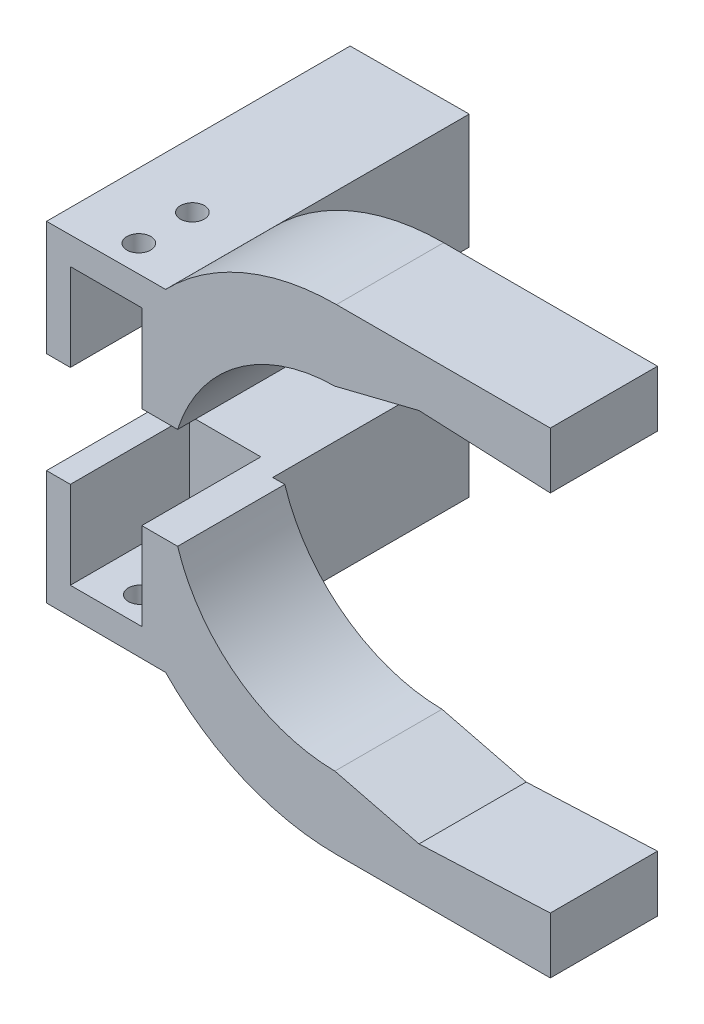
ISO-10303-21;
HEADER;
FILE_DESCRIPTION(('STEP AP214'),'2;1');
FILE_NAME('part.step','',(''),(''),'','','');
FILE_SCHEMA(('AUTOMOTIVE_DESIGN { 1 0 10303 214 1 1 1 1 }'));
ENDSEC;
DATA;
#1=APPLICATION_CONTEXT('core data for automotive mechanical design processes');
#2=APPLICATION_PROTOCOL_DEFINITION('international standard','automotive_design',2000,#1);
#3=PRODUCT_CONTEXT('',#1,'mechanical');
#4=PRODUCT('Part','Part','',(#3));
#5=PRODUCT_RELATED_PRODUCT_CATEGORY('part','',(#4));
#6=PRODUCT_DEFINITION_FORMATION('','',#4);
#7=PRODUCT_DEFINITION_CONTEXT('part definition',#1,'design');
#8=PRODUCT_DEFINITION('design','',#6,#7);
#9=PRODUCT_DEFINITION_SHAPE('','',#8);
#10=(LENGTH_UNIT() NAMED_UNIT(*) SI_UNIT(.MILLI.,.METRE.));
#11=(NAMED_UNIT(*) PLANE_ANGLE_UNIT() SI_UNIT($,.RADIAN.));
#12=(NAMED_UNIT(*) SI_UNIT($,.STERADIAN.) SOLID_ANGLE_UNIT());
#13=UNCERTAINTY_MEASURE_WITH_UNIT(LENGTH_MEASURE(1.E-05),#10,'distance_accuracy_value','');
#14=(GEOMETRIC_REPRESENTATION_CONTEXT(3) GLOBAL_UNCERTAINTY_ASSIGNED_CONTEXT((#13)) GLOBAL_UNIT_ASSIGNED_CONTEXT((#10,
#11,#12)) REPRESENTATION_CONTEXT('',''));
#15=CARTESIAN_POINT('',(0.,0.,0.));
#16=DIRECTION('',(0.,0.,1.));
#17=DIRECTION('',(1.,0.,0.));
#18=AXIS2_PLACEMENT_3D('',#15,#16,#17);
#19=CARTESIAN_POINT('',(0.,0.,0.));
#20=DIRECTION('',(0.,0.,1.));
#21=DIRECTION('',(1.,0.,0.));
#22=AXIS2_PLACEMENT_3D('',#19,#20,#21);
#23=PLANE('',#22);
#24=DIRECTION('',(0.999025873944226,-0.0441282584063349,0.));
#25=VECTOR('',#24,1.);
#26=CARTESIAN_POINT('',(35.9219540128851,30.548024479095,0.));
#27=LINE('',#26,#25);
#28=CARTESIAN_POINT('',(13.8660148869028,31.5222636920426,0.));
#29=VERTEX_POINT('',#28);
#30=CARTESIAN_POINT('',(35.9219540128851,30.548024479095,0.));
#31=VERTEX_POINT('',#30);
#32=EDGE_CURVE('E239',#29,#31,#27,.T.);
#33=ORIENTED_EDGE('',*,*,#32,.F.);
#34=DIRECTION('',(0.970314336817087,0.241847240561511,0.));
#35=VECTOR('',#34,1.);
#36=CARTESIAN_POINT('',(13.8660148869028,31.5222636920426,0.));
#37=LINE('',#36,#35);
#38=CARTESIAN_POINT('',(-0.270903050285142,27.9986894610685,0.));
#39=VERTEX_POINT('',#38);
#40=EDGE_CURVE('E409',#39,#29,#37,.T.);
#41=ORIENTED_EDGE('',*,*,#40,.F.);
#42=CARTESIAN_POINT('',(0.,0.,0.));
#43=DIRECTION('',(0.,0.,1.));
#44=DIRECTION('',(1.,0.,0.));
#45=AXIS2_PLACEMENT_3D('',#42,#43,#44);
#46=CIRCLE('',#45,28.);
#47=CARTESIAN_POINT('',(-26.6786431439082,8.49999999999999,0.));
#48=VERTEX_POINT('',#47);
#49=EDGE_CURVE('E286',#39,#48,#46,.T.);
#50=ORIENTED_EDGE('',*,*,#49,.T.);
#51=DIRECTION('',(-1.,0.,0.));
#52=VECTOR('',#51,1.);
#53=CARTESIAN_POINT('',(-67.9705818718657,8.49999999999999,0.));
#54=LINE('',#53,#52);
#55=CARTESIAN_POINT('',(-28.701152123785,8.49999999999999,0.));
#56=VERTEX_POINT('',#55);
#57=EDGE_CURVE('E297',#48,#56,#54,.T.);
#58=ORIENTED_EDGE('',*,*,#57,.T.);
#59=DIRECTION('',(0.,-1.,0.));
#60=VECTOR('',#59,1.);
#61=CARTESIAN_POINT('',(-28.701152123785,0.,0.));
#62=LINE('',#61,#60);
#63=CARTESIAN_POINT('',(-28.701152123785,27.8611533639107,0.));
#64=VERTEX_POINT('',#63);
#65=EDGE_CURVE('E338',#64,#56,#62,.T.);
#66=ORIENTED_EDGE('',*,*,#65,.F.);
#67=CARTESIAN_POINT('',(0.,0.,0.));
#68=DIRECTION('',(0.,0.,1.));
#69=DIRECTION('',(1.,0.,0.));
#70=AXIS2_PLACEMENT_3D('',#67,#68,#69);
#71=CIRCLE('',#70,40.);
#72=CARTESIAN_POINT('',(0.,40.,0.));
#73=VERTEX_POINT('',#72);
#74=EDGE_CURVE('E270',#73,#64,#71,.T.);
#75=ORIENTED_EDGE('',*,*,#74,.F.);
#76=DIRECTION('',(1.,0.,0.));
#77=VECTOR('',#76,1.);
#78=CARTESIAN_POINT('',(0.,40.,0.));
#79=LINE('',#78,#77);
#80=CARTESIAN_POINT('',(35.9219540128851,40.,0.));
#81=VERTEX_POINT('',#80);
#82=EDGE_CURVE('E287',#73,#81,#79,.T.);
#83=ORIENTED_EDGE('',*,*,#82,.T.);
#84=DIRECTION('',(0.,-1.,0.));
#85=VECTOR('',#84,1.);
#86=CARTESIAN_POINT('',(35.9219540128851,0.,0.));
#87=LINE('',#86,#85);
#88=EDGE_CURVE('E283',#81,#31,#87,.T.);
#89=ORIENTED_EDGE('',*,*,#88,.T.);
#90=EDGE_LOOP('',(#33,#41,#50,#58,#66,#75,#83,#89));
#91=FACE_BOUND('',#90,.T.);
#92=ADVANCED_FACE('F128',(#91),#23,.F.);
#93=CARTESIAN_POINT('',(0.,0.,18.));
#94=DIRECTION('',(0.,0.,1.));
#95=DIRECTION('',(1.,0.,0.));
#96=AXIS2_PLACEMENT_3D('',#93,#94,#95);
#97=PLANE('',#96);
#98=DIRECTION('',(-0.970314336817086,-0.241847240561511,0.));
#99=VECTOR('',#98,1.);
#100=CARTESIAN_POINT('',(13.8660148869028,31.5222636920426,18.));
#101=LINE('',#100,#99);
#102=CARTESIAN_POINT('',(13.8660148869028,31.5222636920426,18.));
#103=VERTEX_POINT('',#102);
#104=CARTESIAN_POINT('',(-0.270903050285014,27.9986894610685,18.));
#105=VERTEX_POINT('',#104);
#106=EDGE_CURVE('E145',#103,#105,#101,.T.);
#107=ORIENTED_EDGE('',*,*,#106,.F.);
#108=DIRECTION('',(-0.999025873944226,0.0441282584063349,0.));
#109=VECTOR('',#108,1.);
#110=CARTESIAN_POINT('',(35.9219540128851,30.548024479095,18.));
#111=LINE('',#110,#109);
#112=CARTESIAN_POINT('',(35.9219540128851,30.548024479095,18.));
#113=VERTEX_POINT('',#112);
#114=EDGE_CURVE('E237',#113,#103,#111,.T.);
#115=ORIENTED_EDGE('',*,*,#114,.F.);
#116=DIRECTION('',(0.,-1.,0.));
#117=VECTOR('',#116,1.);
#118=CARTESIAN_POINT('',(35.9219540128851,0.,18.));
#119=LINE('',#118,#117);
#120=CARTESIAN_POINT('',(35.9219540128851,40.,18.));
#121=VERTEX_POINT('',#120);
#122=EDGE_CURVE('E248',#121,#113,#119,.T.);
#123=ORIENTED_EDGE('',*,*,#122,.F.);
#124=DIRECTION('',(1.,0.,0.));
#125=VECTOR('',#124,1.);
#126=CARTESIAN_POINT('',(0.,40.,18.));
#127=LINE('',#126,#125);
#128=CARTESIAN_POINT('',(0.,40.,18.));
#129=VERTEX_POINT('',#128);
#130=EDGE_CURVE('E264',#129,#121,#127,.T.);
#131=ORIENTED_EDGE('',*,*,#130,.F.);
#132=CARTESIAN_POINT('',(0.,0.,18.));
#133=DIRECTION('',(0.,0.,1.));
#134=DIRECTION('',(1.,0.,0.));
#135=AXIS2_PLACEMENT_3D('',#132,#133,#134);
#136=CIRCLE('',#135,40.);
#137=CARTESIAN_POINT('',(-28.701152123785,27.8611533639107,18.));
#138=VERTEX_POINT('',#137);
#139=EDGE_CURVE('E275',#129,#138,#136,.T.);
#140=ORIENTED_EDGE('',*,*,#139,.T.);
#141=DIRECTION('',(0.999988298691079,0.00483761107578984,0.));
#142=VECTOR('',#141,1.);
#143=CARTESIAN_POINT('',(-0.13545152514343,27.9993447305342,18.));
#144=LINE('',#143,#142);
#145=CARTESIAN_POINT('',(-48.701152123785,27.764400010254,18.));
#146=VERTEX_POINT('',#145);
#147=EDGE_CURVE('E271',#146,#138,#144,.T.);
#148=ORIENTED_EDGE('',*,*,#147,.F.);
#149=DIRECTION('',(0.,1.,0.));
#150=VECTOR('',#149,1.);
#151=CARTESIAN_POINT('',(-48.701152123785,0.,18.));
#152=LINE('',#151,#150);
#153=CARTESIAN_POINT('',(-48.701152123785,8.5,18.));
#154=VERTEX_POINT('',#153);
#155=EDGE_CURVE('E13',#154,#146,#152,.T.);
#156=ORIENTED_EDGE('',*,*,#155,.F.);
#157=DIRECTION('',(-1.,0.,0.));
#158=VECTOR('',#157,1.);
#159=CARTESIAN_POINT('',(0.,8.5,18.));
#160=LINE('',#159,#158);
#161=CARTESIAN_POINT('',(-44.701152123785,8.5,18.));
#162=VERTEX_POINT('',#161);
#163=EDGE_CURVE('E312',#162,#154,#160,.T.);
#164=ORIENTED_EDGE('',*,*,#163,.F.);
#165=DIRECTION('',(0.,-1.,0.));
#166=VECTOR('',#165,1.);
#167=CARTESIAN_POINT('',(-44.701152123785,23.1805766819553,18.));
#168=LINE('',#167,#166);
#169=CARTESIAN_POINT('',(-44.701152123785,23.1805766819553,18.));
#170=VERTEX_POINT('',#169);
#171=EDGE_CURVE('E369',#170,#162,#168,.T.);
#172=ORIENTED_EDGE('',*,*,#171,.F.);
#173=DIRECTION('',(-1.,0.,0.));
#174=VECTOR('',#173,1.);
#175=CARTESIAN_POINT('',(-32.701152123785,23.1805766819553,18.));
#176=LINE('',#175,#174);
#177=CARTESIAN_POINT('',(-32.701152123785,23.1805766819553,18.));
#178=VERTEX_POINT('',#177);
#179=EDGE_CURVE('E153',#178,#170,#176,.T.);
#180=ORIENTED_EDGE('',*,*,#179,.F.);
#181=DIRECTION('',(0.,1.,0.));
#182=VECTOR('',#181,1.);
#183=CARTESIAN_POINT('',(-32.701152123785,13.1805766819553,18.));
#184=LINE('',#183,#182);
#185=CARTESIAN_POINT('',(-32.701152123785,8.5,18.));
#186=VERTEX_POINT('',#185);
#187=EDGE_CURVE('E358',#186,#178,#184,.T.);
#188=ORIENTED_EDGE('',*,*,#187,.F.);
#189=CARTESIAN_POINT('',(-26.6786431439082,8.49999999999999,18.));
#190=VERTEX_POINT('',#189);
#191=EDGE_CURVE('E132',#190,#186,#160,.T.);
#192=ORIENTED_EDGE('',*,*,#191,.F.);
#193=CARTESIAN_POINT('',(0.,0.,18.));
#194=DIRECTION('',(0.,0.,1.));
#195=DIRECTION('',(1.,0.,0.));
#196=AXIS2_PLACEMENT_3D('',#193,#194,#195);
#197=CIRCLE('',#196,28.);
#198=EDGE_CURVE('E262',#105,#190,#197,.T.);
#199=ORIENTED_EDGE('',*,*,#198,.F.);
#200=EDGE_LOOP('',(#107,#115,#123,#131,#140,#148,#156,#164,#172,#180,#188,#192,#199));
#201=FACE_BOUND('',#200,.T.);
#202=ADVANCED_FACE('F130',(#201),#97,.T.);
#203=CARTESIAN_POINT('',(0.,8.5,18.));
#204=DIRECTION('',(0.,-1.,0.));
#205=DIRECTION('',(1.,0.,0.));
#206=AXIS2_PLACEMENT_3D('',#203,#204,#205);
#207=PLANE('',#206);
#208=DIRECTION('',(0.,0.,1.));
#209=VECTOR('',#208,1.);
#210=CARTESIAN_POINT('',(-32.701152123785,8.5,18.));
#211=LINE('',#210,#209);
#212=CARTESIAN_POINT('',(-32.701152123785,8.5,-2.));
#213=VERTEX_POINT('',#212);
#214=EDGE_CURVE('E393',#213,#186,#211,.T.);
#215=ORIENTED_EDGE('',*,*,#214,.F.);
#216=DIRECTION('',(-1.,0.,0.));
#217=VECTOR('',#216,1.);
#218=CARTESIAN_POINT('',(0.,8.5,-2.));
#219=LINE('',#218,#217);
#220=CARTESIAN_POINT('',(-44.701152123785,8.5,-2.));
#221=VERTEX_POINT('',#220);
#222=EDGE_CURVE('E404',#213,#221,#219,.T.);
#223=ORIENTED_EDGE('',*,*,#222,.T.);
#224=DIRECTION('',(0.,0.,-1.));
#225=VECTOR('',#224,1.);
#226=CARTESIAN_POINT('',(-44.701152123785,8.5,18.));
#227=LINE('',#226,#225);
#228=EDGE_CURVE('E400',#162,#221,#227,.T.);
#229=ORIENTED_EDGE('',*,*,#228,.F.);
#230=ORIENTED_EDGE('',*,*,#163,.T.);
#231=DIRECTION('',(0.,0.,1.));
#232=VECTOR('',#231,1.);
#233=CARTESIAN_POINT('',(-48.701152123785,8.5,18.));
#234=LINE('',#233,#232);
#235=CARTESIAN_POINT('',(-48.701152123785,8.5,-33.));
#236=VERTEX_POINT('',#235);
#237=EDGE_CURVE('E138',#236,#154,#234,.T.);
#238=ORIENTED_EDGE('',*,*,#237,.F.);
#239=DIRECTION('',(-1.,0.,0.));
#240=VECTOR('',#239,1.);
#241=CARTESIAN_POINT('',(0.,8.49999999999999,-33.));
#242=LINE('',#241,#240);
#243=CARTESIAN_POINT('',(-28.701152123785,8.49999999999999,-33.));
#244=VERTEX_POINT('',#243);
#245=EDGE_CURVE('E337',#244,#236,#242,.T.);
#246=ORIENTED_EDGE('',*,*,#245,.F.);
#247=DIRECTION('',(0.,0.,1.));
#248=VECTOR('',#247,1.);
#249=CARTESIAN_POINT('',(-28.701152123785,8.49999999999999,-33.));
#250=LINE('',#249,#248);
#251=EDGE_CURVE('E333',#244,#56,#250,.T.);
#252=ORIENTED_EDGE('',*,*,#251,.T.);
#253=ORIENTED_EDGE('',*,*,#57,.F.);
#254=DIRECTION('',(0.,0.,1.));
#255=VECTOR('',#254,1.);
#256=CARTESIAN_POINT('',(-26.6786431439082,8.49999999999999,0.));
#257=LINE('',#256,#255);
#258=EDGE_CURVE('E279',#48,#190,#257,.T.);
#259=ORIENTED_EDGE('',*,*,#258,.T.);
#260=ORIENTED_EDGE('',*,*,#191,.T.);
#261=EDGE_LOOP('',(#215,#223,#229,#230,#238,#246,#252,#253,#259,#260));
#262=FACE_BOUND('',#261,.T.);
#263=ADVANCED_FACE('F441',(#262),#207,.T.);
#264=CARTESIAN_POINT('',(-0.13545152514343,27.9993447305342,0.));
#265=DIRECTION('',(0.00483761107578984,-0.999988298691079,0.));
#266=DIRECTION('',(0.99998829869108,0.00483761107578984,0.));
#267=AXIS2_PLACEMENT_3D('',#264,#265,#266);
#268=PLANE('',#267);
#269=CARTESIAN_POINT('',(-37.7010468120047,27.8176148642286,13.5));
#270=DIRECTION('',(-0.00483761107578984,0.99998829869108,0.));
#271=DIRECTION('',(-0.99998829869108,-0.00483761107578984,0.));
#272=AXIS2_PLACEMENT_3D('',#269,#270,#271);
#273=CIRCLE('',#272,2.);
#274=CARTESIAN_POINT('',(-39.7010234093869,27.807939642077,13.5));
#275=VERTEX_POINT('',#274);
#276=EDGE_CURVE('E388',#275,#275,#273,.T.);
#277=ORIENTED_EDGE('',*,*,#276,.F.);
#278=EDGE_LOOP('',(#277));
#279=FACE_BOUND('',#278,.T.);
#280=CARTESIAN_POINT('',(-37.7010468120047,27.8176148642286,4.5));
#281=DIRECTION('',(-0.00483761107578984,0.99998829869108,0.));
#282=DIRECTION('',(-0.99998829869108,-0.00483761107578984,0.));
#283=AXIS2_PLACEMENT_3D('',#280,#281,#282);
#284=CIRCLE('',#283,2.);
#285=CARTESIAN_POINT('',(-39.7010234093869,27.807939642077,4.5));
#286=VERTEX_POINT('',#285);
#287=EDGE_CURVE('E389',#286,#286,#284,.T.);
#288=ORIENTED_EDGE('',*,*,#287,.F.);
#289=EDGE_LOOP('',(#288));
#290=FACE_BOUND('',#289,.T.);
#291=DIRECTION('',(0.,0.,1.));
#292=VECTOR('',#291,1.);
#293=CARTESIAN_POINT('',(-28.701152123785,27.8611533639107,0.));
#294=LINE('',#293,#292);
#295=EDGE_CURVE('E293',#64,#138,#294,.T.);
#296=ORIENTED_EDGE('',*,*,#295,.F.);
#297=DIRECTION('',(0.,0.,1.));
#298=VECTOR('',#297,1.);
#299=CARTESIAN_POINT('',(-28.701152123785,27.8611533639107,-33.));
#300=LINE('',#299,#298);
#301=CARTESIAN_POINT('',(-28.701152123785,27.8611533639107,-33.));
#302=VERTEX_POINT('',#301);
#303=EDGE_CURVE('E280',#302,#64,#300,.T.);
#304=ORIENTED_EDGE('',*,*,#303,.F.);
#305=DIRECTION('',(0.999988298691079,0.00483761107578991,0.));
#306=VECTOR('',#305,1.);
#307=CARTESIAN_POINT('',(-0.135451525143432,27.9993447305342,-33.));
#308=LINE('',#307,#306);
#309=CARTESIAN_POINT('',(-48.701152123785,27.764400010254,-33.));
#310=VERTEX_POINT('',#309);
#311=EDGE_CURVE('E348',#310,#302,#308,.T.);
#312=ORIENTED_EDGE('',*,*,#311,.F.);
#313=DIRECTION('',(0.,0.,1.));
#314=VECTOR('',#313,1.);
#315=CARTESIAN_POINT('',(-48.701152123785,27.764400010254,0.));
#316=LINE('',#315,#314);
#317=EDGE_CURVE('E274',#310,#146,#316,.T.);
#318=ORIENTED_EDGE('',*,*,#317,.T.);
#319=ORIENTED_EDGE('',*,*,#147,.T.);
#320=EDGE_LOOP('',(#296,#304,#312,#318,#319));
#321=FACE_BOUND('',#320,.T.);
#322=ADVANCED_FACE('F435',(#279,#290,#321),#268,.F.);
#323=CARTESIAN_POINT('',(0.,40.,0.));
#324=DIRECTION('',(0.,-1.,0.));
#325=DIRECTION('',(0.,0.,-1.));
#326=AXIS2_PLACEMENT_3D('',#323,#324,#325);
#327=PLANE('',#326);
#328=ORIENTED_EDGE('',*,*,#130,.T.);
#329=DIRECTION('',(0.,0.,1.));
#330=VECTOR('',#329,1.);
#331=CARTESIAN_POINT('',(35.9219540128851,40.,0.));
#332=LINE('',#331,#330);
#333=EDGE_CURVE('E255',#81,#121,#332,.T.);
#334=ORIENTED_EDGE('',*,*,#333,.F.);
#335=ORIENTED_EDGE('',*,*,#82,.F.);
#336=DIRECTION('',(0.,0.,1.));
#337=VECTOR('',#336,1.);
#338=CARTESIAN_POINT('',(0.,40.,0.));
#339=LINE('',#338,#337);
#340=EDGE_CURVE('E258',#73,#129,#339,.T.);
#341=ORIENTED_EDGE('',*,*,#340,.T.);
#342=EDGE_LOOP('',(#328,#334,#335,#341));
#343=FACE_BOUND('',#342,.T.);
#344=ADVANCED_FACE('F425',(#343),#327,.F.);
#345=CARTESIAN_POINT('',(35.9219540128851,0.,0.));
#346=DIRECTION('',(-1.,0.,0.));
#347=DIRECTION('',(0.,0.,1.));
#348=AXIS2_PLACEMENT_3D('',#345,#346,#347);
#349=PLANE('',#348);
#350=ORIENTED_EDGE('',*,*,#122,.T.);
#351=DIRECTION('',(0.,0.,1.));
#352=VECTOR('',#351,1.);
#353=CARTESIAN_POINT('',(35.9219540128851,30.548024479095,-36.3639722494154));
#354=LINE('',#353,#352);
#355=EDGE_CURVE('E233',#31,#113,#354,.T.);
#356=ORIENTED_EDGE('',*,*,#355,.F.);
#357=ORIENTED_EDGE('',*,*,#88,.F.);
#358=ORIENTED_EDGE('',*,*,#333,.T.);
#359=EDGE_LOOP('',(#350,#356,#357,#358));
#360=FACE_BOUND('',#359,.T.);
#361=ADVANCED_FACE('F253',(#360),#349,.F.);
#362=CARTESIAN_POINT('',(0.,0.,0.));
#363=DIRECTION('',(0.,0.,1.));
#364=DIRECTION('',(1.,0.,0.));
#365=AXIS2_PLACEMENT_3D('',#362,#363,#364);
#366=CYLINDRICAL_SURFACE('',#365,28.);
#367=ORIENTED_EDGE('',*,*,#49,.F.);
#368=DIRECTION('',(0.,0.,1.));
#369=VECTOR('',#368,1.);
#370=CARTESIAN_POINT('',(-0.270903050285142,27.9986894610685,-36.3639722494154));
#371=LINE('',#370,#369);
#372=EDGE_CURVE('E413',#39,#105,#371,.T.);
#373=ORIENTED_EDGE('',*,*,#372,.T.);
#374=ORIENTED_EDGE('',*,*,#198,.T.);
#375=ORIENTED_EDGE('',*,*,#258,.F.);
#376=EDGE_LOOP('',(#367,#373,#374,#375));
#377=FACE_BOUND('',#376,.T.);
#378=ADVANCED_FACE('F443',(#377),#366,.F.);
#379=CARTESIAN_POINT('',(0.,0.,0.));
#380=DIRECTION('',(0.,0.,1.));
#381=DIRECTION('',(1.,0.,0.));
#382=AXIS2_PLACEMENT_3D('',#379,#380,#381);
#383=CYLINDRICAL_SURFACE('',#382,40.);
#384=ORIENTED_EDGE('',*,*,#139,.F.);
#385=ORIENTED_EDGE('',*,*,#340,.F.);
#386=ORIENTED_EDGE('',*,*,#74,.T.);
#387=ORIENTED_EDGE('',*,*,#295,.T.);
#388=EDGE_LOOP('',(#384,#385,#386,#387));
#389=FACE_BOUND('',#388,.T.);
#390=ADVANCED_FACE('F427',(#389),#383,.T.);
#391=CARTESIAN_POINT('',(-48.701152123785,0.,-106.275099274108));
#392=DIRECTION('',(1.,0.,0.));
#393=DIRECTION('',(0.,0.,-1.));
#394=AXIS2_PLACEMENT_3D('',#391,#392,#393);
#395=PLANE('',#394);
#396=ORIENTED_EDGE('',*,*,#237,.T.);
#397=ORIENTED_EDGE('',*,*,#155,.T.);
#398=ORIENTED_EDGE('',*,*,#317,.F.);
#399=DIRECTION('',(0.,1.,0.));
#400=VECTOR('',#399,1.);
#401=CARTESIAN_POINT('',(-48.701152123785,0.,-33.));
#402=LINE('',#401,#400);
#403=EDGE_CURVE('E341',#236,#310,#402,.T.);
#404=ORIENTED_EDGE('',*,*,#403,.F.);
#405=EDGE_LOOP('',(#396,#397,#398,#404));
#406=FACE_BOUND('',#405,.T.);
#407=ADVANCED_FACE('F437',(#406),#395,.F.);
#408=CARTESIAN_POINT('',(-28.701152123785,0.,-33.));
#409=DIRECTION('',(-1.,0.,0.));
#410=DIRECTION('',(0.,0.,1.));
#411=AXIS2_PLACEMENT_3D('',#408,#409,#410);
#412=PLANE('',#411);
#413=ORIENTED_EDGE('',*,*,#65,.T.);
#414=ORIENTED_EDGE('',*,*,#251,.F.);
#415=DIRECTION('',(0.,-1.,0.));
#416=VECTOR('',#415,1.);
#417=CARTESIAN_POINT('',(-28.701152123785,0.,-33.));
#418=LINE('',#417,#416);
#419=EDGE_CURVE('E345',#302,#244,#418,.T.);
#420=ORIENTED_EDGE('',*,*,#419,.F.);
#421=ORIENTED_EDGE('',*,*,#303,.T.);
#422=EDGE_LOOP('',(#413,#414,#420,#421));
#423=FACE_BOUND('',#422,.T.);
#424=ADVANCED_FACE('F431',(#423),#412,.F.);
#425=CARTESIAN_POINT('',(0.,0.,-33.));
#426=DIRECTION('',(0.,0.,-1.));
#427=DIRECTION('',(-1.,0.,0.));
#428=AXIS2_PLACEMENT_3D('',#425,#426,#427);
#429=PLANE('',#428);
#430=ORIENTED_EDGE('',*,*,#403,.T.);
#431=ORIENTED_EDGE('',*,*,#311,.T.);
#432=ORIENTED_EDGE('',*,*,#419,.T.);
#433=ORIENTED_EDGE('',*,*,#245,.T.);
#434=EDGE_LOOP('',(#430,#431,#432,#433));
#435=FACE_BOUND('',#434,.T.);
#436=ADVANCED_FACE('F439',(#435),#429,.T.);
#437=CARTESIAN_POINT('',(-32.701152123785,23.1805766819553,-2.));
#438=DIRECTION('',(0.,1.,0.));
#439=DIRECTION('',(-1.,0.,0.));
#440=AXIS2_PLACEMENT_3D('',#437,#438,#439);
#441=PLANE('',#440);
#442=CARTESIAN_POINT('',(-37.6786143622463,23.1805766819553,13.5));
#443=DIRECTION('',(0.,1.,0.));
#444=DIRECTION('',(-1.,0.,0.));
#445=AXIS2_PLACEMENT_3D('',#442,#443,#444);
#446=ELLIPSE('',#445,2.00002340289168,2.);
#447=CARTESIAN_POINT('',(-39.678637765138,23.1805766819553,13.5));
#448=VERTEX_POINT('',#447);
#449=EDGE_CURVE('E378',#448,#448,#446,.T.);
#450=ORIENTED_EDGE('',*,*,#449,.T.);
#451=EDGE_LOOP('',(#450));
#452=FACE_BOUND('',#451,.T.);
#453=CARTESIAN_POINT('',(-37.6786143622463,23.1805766819553,4.5));
#454=DIRECTION('',(0.,1.,0.));
#455=DIRECTION('',(-1.,0.,0.));
#456=AXIS2_PLACEMENT_3D('',#453,#454,#455);
#457=ELLIPSE('',#456,2.00002340289168,2.);
#458=CARTESIAN_POINT('',(-39.678637765138,23.1805766819553,4.5));
#459=VERTEX_POINT('',#458);
#460=EDGE_CURVE('E384',#459,#459,#457,.T.);
#461=ORIENTED_EDGE('',*,*,#460,.T.);
#462=EDGE_LOOP('',(#461));
#463=FACE_BOUND('',#462,.T.);
#464=ORIENTED_EDGE('',*,*,#179,.T.);
#465=DIRECTION('',(0.,0.,1.));
#466=VECTOR('',#465,1.);
#467=CARTESIAN_POINT('',(-44.701152123785,23.1805766819553,-2.));
#468=LINE('',#467,#466);
#469=CARTESIAN_POINT('',(-44.701152123785,23.1805766819553,-2.));
#470=VERTEX_POINT('',#469);
#471=EDGE_CURVE('E366',#470,#170,#468,.T.);
#472=ORIENTED_EDGE('',*,*,#471,.F.);
#473=DIRECTION('',(-1.,0.,0.));
#474=VECTOR('',#473,1.);
#475=CARTESIAN_POINT('',(-32.701152123785,23.1805766819553,-2.));
#476=LINE('',#475,#474);
#477=CARTESIAN_POINT('',(-32.701152123785,23.1805766819553,-2.));
#478=VERTEX_POINT('',#477);
#479=EDGE_CURVE('E354',#478,#470,#476,.T.);
#480=ORIENTED_EDGE('',*,*,#479,.F.);
#481=DIRECTION('',(0.,0.,1.));
#482=VECTOR('',#481,1.);
#483=CARTESIAN_POINT('',(-32.701152123785,23.1805766819553,-2.));
#484=LINE('',#483,#482);
#485=EDGE_CURVE('E375',#478,#178,#484,.T.);
#486=ORIENTED_EDGE('',*,*,#485,.T.);
#487=EDGE_LOOP('',(#464,#472,#480,#486));
#488=FACE_BOUND('',#487,.T.);
#489=ADVANCED_FACE('F453',(#452,#463,#488),#441,.F.);
#490=CARTESIAN_POINT('',(-32.701152123785,13.1805766819553,-2.));
#491=DIRECTION('',(1.,0.,0.));
#492=DIRECTION('',(0.,0.,-1.));
#493=AXIS2_PLACEMENT_3D('',#490,#491,#492);
#494=PLANE('',#493);
#495=ORIENTED_EDGE('',*,*,#187,.T.);
#496=ORIENTED_EDGE('',*,*,#485,.F.);
#497=DIRECTION('',(0.,1.,0.));
#498=VECTOR('',#497,1.);
#499=CARTESIAN_POINT('',(-32.701152123785,13.1805766819553,-2.));
#500=LINE('',#499,#498);
#501=EDGE_CURVE('E362',#213,#478,#500,.T.);
#502=ORIENTED_EDGE('',*,*,#501,.F.);
#503=ORIENTED_EDGE('',*,*,#214,.T.);
#504=EDGE_LOOP('',(#495,#496,#502,#503));
#505=FACE_BOUND('',#504,.T.);
#506=ADVANCED_FACE('F445',(#505),#494,.F.);
#507=CARTESIAN_POINT('',(-44.701152123785,23.1805766819553,-2.));
#508=DIRECTION('',(-1.,0.,0.));
#509=DIRECTION('',(0.,0.,1.));
#510=AXIS2_PLACEMENT_3D('',#507,#508,#509);
#511=PLANE('',#510);
#512=ORIENTED_EDGE('',*,*,#171,.T.);
#513=ORIENTED_EDGE('',*,*,#228,.T.);
#514=DIRECTION('',(0.,-1.,0.));
#515=VECTOR('',#514,1.);
#516=CARTESIAN_POINT('',(-44.701152123785,23.1805766819553,-2.));
#517=LINE('',#516,#515);
#518=EDGE_CURVE('E359',#470,#221,#517,.T.);
#519=ORIENTED_EDGE('',*,*,#518,.F.);
#520=ORIENTED_EDGE('',*,*,#471,.T.);
#521=EDGE_LOOP('',(#512,#513,#519,#520));
#522=FACE_BOUND('',#521,.T.);
#523=ADVANCED_FACE('F452',(#522),#511,.F.);
#524=CARTESIAN_POINT('',(0.,0.,-2.));
#525=DIRECTION('',(0.,0.,1.));
#526=DIRECTION('',(1.,0.,0.));
#527=AXIS2_PLACEMENT_3D('',#524,#525,#526);
#528=PLANE('',#527);
#529=ORIENTED_EDGE('',*,*,#479,.T.);
#530=ORIENTED_EDGE('',*,*,#518,.T.);
#531=ORIENTED_EDGE('',*,*,#222,.F.);
#532=ORIENTED_EDGE('',*,*,#501,.T.);
#533=EDGE_LOOP('',(#529,#530,#531,#532));
#534=FACE_BOUND('',#533,.T.);
#535=ADVANCED_FACE('F448',(#534),#528,.T.);
#536=CARTESIAN_POINT('',(-37.4045294589448,-33.4758373735381,4.5));
#537=DIRECTION('',(-0.00483761107578984,0.999988298691079,0.));
#538=DIRECTION('',(-0.999988298691079,-0.00483761107578984,0.));
#539=AXIS2_PLACEMENT_3D('',#536,#537,#538);
#540=CYLINDRICAL_SURFACE('',#539,2.);
#541=ORIENTED_EDGE('',*,*,#287,.T.);
#542=EDGE_LOOP('',(#541));
#543=FACE_BOUND('',#542,.T.);
#544=ORIENTED_EDGE('',*,*,#460,.F.);
#545=EDGE_LOOP('',(#544));
#546=FACE_BOUND('',#545,.T.);
#547=ADVANCED_FACE('F512',(#543,#546),#540,.F.);
#548=CARTESIAN_POINT('',(-37.4045294589448,-33.4758373735381,13.5));
#549=DIRECTION('',(-0.00483761107578984,0.999988298691079,0.));
#550=DIRECTION('',(-0.999988298691079,-0.00483761107578984,0.));
#551=AXIS2_PLACEMENT_3D('',#548,#549,#550);
#552=CYLINDRICAL_SURFACE('',#551,2.);
#553=ORIENTED_EDGE('',*,*,#276,.T.);
#554=EDGE_LOOP('',(#553));
#555=FACE_BOUND('',#554,.T.);
#556=ORIENTED_EDGE('',*,*,#449,.F.);
#557=EDGE_LOOP('',(#556));
#558=FACE_BOUND('',#557,.T.);
#559=ADVANCED_FACE('F496',(#555,#558),#552,.F.);
#560=CARTESIAN_POINT('',(13.8660148869028,31.5222636920426,-36.3639722494154));
#561=DIRECTION('',(-0.241847240561511,0.970314336817087,0.));
#562=DIRECTION('',(-0.970314336817087,-0.241847240561511,0.));
#563=AXIS2_PLACEMENT_3D('',#560,#561,#562);
#564=PLANE('',#563);
#565=ORIENTED_EDGE('',*,*,#40,.T.);
#566=DIRECTION('',(0.,0.,1.));
#567=VECTOR('',#566,1.);
#568=CARTESIAN_POINT('',(13.8660148869028,31.5222636920426,-36.3639722494154));
#569=LINE('',#568,#567);
#570=EDGE_CURVE('E244',#29,#103,#569,.T.);
#571=ORIENTED_EDGE('',*,*,#570,.T.);
#572=ORIENTED_EDGE('',*,*,#106,.T.);
#573=ORIENTED_EDGE('',*,*,#372,.F.);
#574=EDGE_LOOP('',(#565,#571,#572,#573));
#575=FACE_BOUND('',#574,.T.);
#576=ADVANCED_FACE('F420',(#575),#564,.F.);
#577=CARTESIAN_POINT('',(35.9219540128851,30.548024479095,-36.3639722494154));
#578=DIRECTION('',(0.0441282584063349,0.999025873944225,0.));
#579=DIRECTION('',(-0.999025873944226,0.0441282584063349,0.));
#580=AXIS2_PLACEMENT_3D('',#577,#578,#579);
#581=PLANE('',#580);
#582=ORIENTED_EDGE('',*,*,#32,.T.);
#583=ORIENTED_EDGE('',*,*,#355,.T.);
#584=ORIENTED_EDGE('',*,*,#114,.T.);
#585=ORIENTED_EDGE('',*,*,#570,.F.);
#586=EDGE_LOOP('',(#582,#583,#584,#585));
#587=FACE_BOUND('',#586,.T.);
#588=ADVANCED_FACE('F235',(#587),#581,.F.);
#589=CLOSED_SHELL('',(#92,#202,#263,#322,#344,#361,#378,#390,#407,#424,#436,#489,#506,#523,#535,
#547,#559,#576,#588));
#590=MANIFOLD_SOLID_BREP('B2',#589);
#591=CARTESIAN_POINT('',(0.,0.,18.));
#592=DIRECTION('',(0.,0.,1.));
#593=DIRECTION('',(1.,0.,0.));
#594=AXIS2_PLACEMENT_3D('',#591,#592,#593);
#595=PLANE('',#594);
#596=DIRECTION('',(-0.999025873944226,-0.0441282584063349,0.));
#597=VECTOR('',#596,1.);
#598=CARTESIAN_POINT('',(35.9219540128851,-30.548024479095,18.));
#599=LINE('',#598,#597);
#600=CARTESIAN_POINT('',(35.9219540128851,-30.548024479095,18.));
#601=VERTEX_POINT('',#600);
#602=CARTESIAN_POINT('',(13.8660148869028,-31.5222636920426,18.));
#603=VERTEX_POINT('',#602);
#604=EDGE_CURVE('E699',#601,#603,#599,.T.);
#605=ORIENTED_EDGE('',*,*,#604,.T.);
#606=DIRECTION('',(-0.970314336817086,0.241847240561511,0.));
#607=VECTOR('',#606,1.);
#608=CARTESIAN_POINT('',(13.8660148869028,-31.5222636920426,18.));
#609=LINE('',#608,#607);
#610=CARTESIAN_POINT('',(-0.270903050285142,-27.9986894610685,18.));
#611=VERTEX_POINT('',#610);
#612=EDGE_CURVE('E800',#603,#611,#609,.T.);
#613=ORIENTED_EDGE('',*,*,#612,.T.);
#614=CARTESIAN_POINT('',(0.,0.,18.));
#615=DIRECTION('',(0.,0.,1.));
#616=DIRECTION('',(1.,0.,0.));
#617=AXIS2_PLACEMENT_3D('',#614,#615,#616);
#618=CIRCLE('',#617,28.);
#619=CARTESIAN_POINT('',(-26.6786431439082,-8.49999999999999,18.));
#620=VERTEX_POINT('',#619);
#621=EDGE_CURVE('E873',#620,#611,#618,.T.);
#622=ORIENTED_EDGE('',*,*,#621,.F.);
#623=DIRECTION('',(1.,0.,0.));
#624=VECTOR('',#623,1.);
#625=CARTESIAN_POINT('',(0.,-8.49999999999999,18.));
#626=LINE('',#625,#624);
#627=CARTESIAN_POINT('',(-32.701152123785,-8.49999999999999,18.));
#628=VERTEX_POINT('',#627);
#629=EDGE_CURVE('E887',#628,#620,#626,.T.);
#630=ORIENTED_EDGE('',*,*,#629,.F.);
#631=DIRECTION('',(0.,1.,0.));
#632=VECTOR('',#631,1.);
#633=CARTESIAN_POINT('',(-32.701152123785,-13.1805766819553,18.));
#634=LINE('',#633,#632);
#635=CARTESIAN_POINT('',(-32.701152123785,-23.1805766819553,18.));
#636=VERTEX_POINT('',#635);
#637=EDGE_CURVE('E830',#636,#628,#634,.T.);
#638=ORIENTED_EDGE('',*,*,#637,.F.);
#639=DIRECTION('',(1.,0.,0.));
#640=VECTOR('',#639,1.);
#641=CARTESIAN_POINT('',(-32.701152123785,-23.1805766819553,18.));
#642=LINE('',#641,#640);
#643=CARTESIAN_POINT('',(-44.701152123785,-23.1805766819553,18.));
#644=VERTEX_POINT('',#643);
#645=EDGE_CURVE('E837',#644,#636,#642,.T.);
#646=ORIENTED_EDGE('',*,*,#645,.F.);
#647=DIRECTION('',(0.,-1.,0.));
#648=VECTOR('',#647,1.);
#649=CARTESIAN_POINT('',(-44.701152123785,-23.1805766819553,18.));
#650=LINE('',#649,#648);
#651=CARTESIAN_POINT('',(-44.701152123785,-8.49999999999999,18.));
#652=VERTEX_POINT('',#651);
#653=EDGE_CURVE('E707',#652,#644,#650,.T.);
#654=ORIENTED_EDGE('',*,*,#653,.F.);
#655=CARTESIAN_POINT('',(-48.701152123785,-8.49999999999999,18.));
#656=VERTEX_POINT('',#655);
#657=EDGE_CURVE('E868',#656,#652,#626,.T.);
#658=ORIENTED_EDGE('',*,*,#657,.F.);
#659=DIRECTION('',(0.,1.,0.));
#660=VECTOR('',#659,1.);
#661=CARTESIAN_POINT('',(-48.701152123785,0.,18.));
#662=LINE('',#661,#660);
#663=CARTESIAN_POINT('',(-48.701152123785,-27.764400010254,18.));
#664=VERTEX_POINT('',#663);
#665=EDGE_CURVE('E691',#664,#656,#662,.T.);
#666=ORIENTED_EDGE('',*,*,#665,.F.);
#667=DIRECTION('',(0.999988298691079,-0.00483761107578989,0.));
#668=VECTOR('',#667,1.);
#669=CARTESIAN_POINT('',(-0.135451525143431,-27.9993447305342,18.));
#670=LINE('',#669,#668);
#671=CARTESIAN_POINT('',(-28.701152123785,-27.8611533639107,18.));
#672=VERTEX_POINT('',#671);
#673=EDGE_CURVE('E862',#664,#672,#670,.T.);
#674=ORIENTED_EDGE('',*,*,#673,.T.);
#675=CARTESIAN_POINT('',(0.,0.,18.));
#676=DIRECTION('',(0.,0.,1.));
#677=DIRECTION('',(1.,0.,0.));
#678=AXIS2_PLACEMENT_3D('',#675,#676,#677);
#679=CIRCLE('',#678,40.);
#680=CARTESIAN_POINT('',(0.,-40.,18.));
#681=VERTEX_POINT('',#680);
#682=EDGE_CURVE('E888',#672,#681,#679,.T.);
#683=ORIENTED_EDGE('',*,*,#682,.T.);
#684=DIRECTION('',(1.,0.,0.));
#685=VECTOR('',#684,1.);
#686=CARTESIAN_POINT('',(0.,-40.,18.));
#687=LINE('',#686,#685);
#688=CARTESIAN_POINT('',(35.9219540128851,-40.,18.));
#689=VERTEX_POINT('',#688);
#690=EDGE_CURVE('E884',#681,#689,#687,.T.);
#691=ORIENTED_EDGE('',*,*,#690,.T.);
#692=DIRECTION('',(0.,-1.,0.));
#693=VECTOR('',#692,1.);
#694=CARTESIAN_POINT('',(35.9219540128851,0.,18.));
#695=LINE('',#694,#693);
#696=EDGE_CURVE('E872',#601,#689,#695,.T.);
#697=ORIENTED_EDGE('',*,*,#696,.F.);
#698=EDGE_LOOP('',(#605,#613,#622,#630,#638,#646,#654,#658,#666,#674,#683,#691,#697));
#699=FACE_BOUND('',#698,.T.);
#700=ADVANCED_FACE('F683',(#699),#595,.T.);
#701=CARTESIAN_POINT('',(0.,0.,0.));
#702=DIRECTION('',(0.,0.,1.));
#703=DIRECTION('',(1.,0.,0.));
#704=AXIS2_PLACEMENT_3D('',#701,#702,#703);
#705=PLANE('',#704);
#706=DIRECTION('',(0.970314336817087,-0.241847240561511,0.));
#707=VECTOR('',#706,1.);
#708=CARTESIAN_POINT('',(13.8660148869028,-31.5222636920426,0.));
#709=LINE('',#708,#707);
#710=CARTESIAN_POINT('',(-0.270903050285142,-27.9986894610685,0.));
#711=VERTEX_POINT('',#710);
#712=CARTESIAN_POINT('',(13.8660148869028,-31.5222636920426,0.));
#713=VERTEX_POINT('',#712);
#714=EDGE_CURVE('E794',#711,#713,#709,.T.);
#715=ORIENTED_EDGE('',*,*,#714,.T.);
#716=DIRECTION('',(0.999025873944226,0.0441282584063349,0.));
#717=VECTOR('',#716,1.);
#718=CARTESIAN_POINT('',(35.9219540128851,-30.548024479095,0.));
#719=LINE('',#718,#717);
#720=CARTESIAN_POINT('',(35.9219540128851,-30.548024479095,0.));
#721=VERTEX_POINT('',#720);
#722=EDGE_CURVE('E785',#713,#721,#719,.T.);
#723=ORIENTED_EDGE('',*,*,#722,.T.);
#724=DIRECTION('',(0.,-1.,0.));
#725=VECTOR('',#724,1.);
#726=CARTESIAN_POINT('',(35.9219540128851,0.,0.));
#727=LINE('',#726,#725);
#728=CARTESIAN_POINT('',(35.9219540128851,-40.,0.));
#729=VERTEX_POINT('',#728);
#730=EDGE_CURVE('E894',#721,#729,#727,.T.);
#731=ORIENTED_EDGE('',*,*,#730,.T.);
#732=DIRECTION('',(1.,0.,0.));
#733=VECTOR('',#732,1.);
#734=CARTESIAN_POINT('',(0.,-40.,0.));
#735=LINE('',#734,#733);
#736=CARTESIAN_POINT('',(0.,-40.,0.));
#737=VERTEX_POINT('',#736);
#738=EDGE_CURVE('E882',#737,#729,#735,.T.);
#739=ORIENTED_EDGE('',*,*,#738,.F.);
#740=CARTESIAN_POINT('',(0.,0.,0.));
#741=DIRECTION('',(0.,0.,1.));
#742=DIRECTION('',(1.,0.,0.));
#743=AXIS2_PLACEMENT_3D('',#740,#741,#742);
#744=CIRCLE('',#743,40.);
#745=CARTESIAN_POINT('',(-28.701152123785,-27.8611533639107,0.));
#746=VERTEX_POINT('',#745);
#747=EDGE_CURVE('E878',#746,#737,#744,.T.);
#748=ORIENTED_EDGE('',*,*,#747,.F.);
#749=DIRECTION('',(0.,1.,0.));
#750=VECTOR('',#749,1.);
#751=CARTESIAN_POINT('',(-28.701152123785,0.,0.));
#752=LINE('',#751,#750);
#753=CARTESIAN_POINT('',(-28.701152123785,-8.49999999999999,0.));
#754=VERTEX_POINT('',#753);
#755=EDGE_CURVE('E843',#746,#754,#752,.T.);
#756=ORIENTED_EDGE('',*,*,#755,.T.);
#757=DIRECTION('',(1.,0.,0.));
#758=VECTOR('',#757,1.);
#759=CARTESIAN_POINT('',(-67.9705818718657,-8.49999999999999,0.));
#760=LINE('',#759,#758);
#761=CARTESIAN_POINT('',(-26.6786431439082,-8.49999999999999,0.));
#762=VERTEX_POINT('',#761);
#763=EDGE_CURVE('E866',#754,#762,#760,.T.);
#764=ORIENTED_EDGE('',*,*,#763,.T.);
#765=CARTESIAN_POINT('',(0.,0.,0.));
#766=DIRECTION('',(0.,0.,1.));
#767=DIRECTION('',(1.,0.,0.));
#768=AXIS2_PLACEMENT_3D('',#765,#766,#767);
#769=CIRCLE('',#768,28.);
#770=EDGE_CURVE('E806',#762,#711,#769,.T.);
#771=ORIENTED_EDGE('',*,*,#770,.T.);
#772=EDGE_LOOP('',(#715,#723,#731,#739,#748,#756,#764,#771));
#773=FACE_BOUND('',#772,.T.);
#774=ADVANCED_FACE('F804',(#773),#705,.F.);
#775=CARTESIAN_POINT('',(0.,0.,0.));
#776=DIRECTION('',(0.,0.,1.));
#777=DIRECTION('',(1.,0.,0.));
#778=AXIS2_PLACEMENT_3D('',#775,#776,#777);
#779=CYLINDRICAL_SURFACE('',#778,28.);
#780=DIRECTION('',(0.,0.,1.));
#781=VECTOR('',#780,1.);
#782=CARTESIAN_POINT('',(-0.270903050285142,-27.9986894610685,-36.3639722494154));
#783=LINE('',#782,#781);
#784=EDGE_CURVE('E801',#711,#611,#783,.T.);
#785=ORIENTED_EDGE('',*,*,#784,.F.);
#786=ORIENTED_EDGE('',*,*,#770,.F.);
#787=DIRECTION('',(0.,0.,1.));
#788=VECTOR('',#787,1.);
#789=CARTESIAN_POINT('',(-26.6786431439082,-8.49999999999999,0.));
#790=LINE('',#789,#788);
#791=EDGE_CURVE('E869',#762,#620,#790,.T.);
#792=ORIENTED_EDGE('',*,*,#791,.T.);
#793=ORIENTED_EDGE('',*,*,#621,.T.);
#794=EDGE_LOOP('',(#785,#786,#792,#793));
#795=FACE_BOUND('',#794,.T.);
#796=ADVANCED_FACE('F932',(#795),#779,.F.);
#797=CARTESIAN_POINT('',(35.9219540128851,0.,0.));
#798=DIRECTION('',(-1.,0.,0.));
#799=DIRECTION('',(0.,0.,1.));
#800=AXIS2_PLACEMENT_3D('',#797,#798,#799);
#801=PLANE('',#800);
#802=DIRECTION('',(0.,0.,1.));
#803=VECTOR('',#802,1.);
#804=CARTESIAN_POINT('',(35.9219540128851,-30.548024479095,-36.3639722494154));
#805=LINE('',#804,#803);
#806=EDGE_CURVE('E790',#721,#601,#805,.T.);
#807=ORIENTED_EDGE('',*,*,#806,.T.);
#808=ORIENTED_EDGE('',*,*,#696,.T.);
#809=DIRECTION('',(0.,0.,1.));
#810=VECTOR('',#809,1.);
#811=CARTESIAN_POINT('',(35.9219540128851,-40.,0.));
#812=LINE('',#811,#810);
#813=EDGE_CURVE('E879',#729,#689,#812,.T.);
#814=ORIENTED_EDGE('',*,*,#813,.F.);
#815=ORIENTED_EDGE('',*,*,#730,.F.);
#816=EDGE_LOOP('',(#807,#808,#814,#815));
#817=FACE_BOUND('',#816,.T.);
#818=ADVANCED_FACE('F982',(#817),#801,.F.);
#819=CARTESIAN_POINT('',(0.,-8.49999999999999,18.));
#820=DIRECTION('',(0.,1.,0.));
#821=DIRECTION('',(0.,0.,1.));
#822=AXIS2_PLACEMENT_3D('',#819,#820,#821);
#823=PLANE('',#822);
#824=DIRECTION('',(0.,0.,-1.));
#825=VECTOR('',#824,1.);
#826=CARTESIAN_POINT('',(-32.701152123785,-8.49999999999999,18.));
#827=LINE('',#826,#825);
#828=CARTESIAN_POINT('',(-32.701152123785,-8.49999999999999,-2.));
#829=VERTEX_POINT('',#828);
#830=EDGE_CURVE('E816',#628,#829,#827,.T.);
#831=ORIENTED_EDGE('',*,*,#830,.F.);
#832=ORIENTED_EDGE('',*,*,#629,.T.);
#833=ORIENTED_EDGE('',*,*,#791,.F.);
#834=ORIENTED_EDGE('',*,*,#763,.F.);
#835=DIRECTION('',(0.,0.,1.));
#836=VECTOR('',#835,1.);
#837=CARTESIAN_POINT('',(-28.701152123785,-8.49999999999999,-33.));
#838=LINE('',#837,#836);
#839=CARTESIAN_POINT('',(-28.701152123785,-8.49999999999999,-33.));
#840=VERTEX_POINT('',#839);
#841=EDGE_CURVE('E856',#840,#754,#838,.T.);
#842=ORIENTED_EDGE('',*,*,#841,.F.);
#843=DIRECTION('',(1.,0.,0.));
#844=VECTOR('',#843,1.);
#845=CARTESIAN_POINT('',(0.,-8.49999999999999,-33.));
#846=LINE('',#845,#844);
#847=CARTESIAN_POINT('',(-48.701152123785,-8.49999999999999,-33.));
#848=VERTEX_POINT('',#847);
#849=EDGE_CURVE('E854',#848,#840,#846,.T.);
#850=ORIENTED_EDGE('',*,*,#849,.F.);
#851=DIRECTION('',(0.,0.,-1.));
#852=VECTOR('',#851,1.);
#853=CARTESIAN_POINT('',(-48.701152123785,-8.49999999999999,18.));
#854=LINE('',#853,#852);
#855=EDGE_CURVE('E126',#656,#848,#854,.T.);
#856=ORIENTED_EDGE('',*,*,#855,.F.);
#857=ORIENTED_EDGE('',*,*,#657,.T.);
#858=DIRECTION('',(0.,0.,1.));
#859=VECTOR('',#858,1.);
#860=CARTESIAN_POINT('',(-44.701152123785,-8.49999999999999,18.));
#861=LINE('',#860,#859);
#862=CARTESIAN_POINT('',(-44.701152123785,-8.49999999999999,-2.));
#863=VERTEX_POINT('',#862);
#864=EDGE_CURVE('E814',#863,#652,#861,.T.);
#865=ORIENTED_EDGE('',*,*,#864,.F.);
#866=DIRECTION('',(1.,0.,0.));
#867=VECTOR('',#866,1.);
#868=CARTESIAN_POINT('',(0.,-8.49999999999999,-2.));
#869=LINE('',#868,#867);
#870=EDGE_CURVE('E811',#863,#829,#869,.T.);
#871=ORIENTED_EDGE('',*,*,#870,.T.);
#872=EDGE_LOOP('',(#831,#832,#833,#834,#842,#850,#856,#857,#865,#871));
#873=FACE_BOUND('',#872,.T.);
#874=ADVANCED_FACE('F945',(#873),#823,.T.);
#875=CARTESIAN_POINT('',(0.,-40.,0.));
#876=DIRECTION('',(0.,-1.,0.));
#877=DIRECTION('',(0.,0.,-1.));
#878=AXIS2_PLACEMENT_3D('',#875,#876,#877);
#879=PLANE('',#878);
#880=ORIENTED_EDGE('',*,*,#690,.F.);
#881=DIRECTION('',(0.,0.,1.));
#882=VECTOR('',#881,1.);
#883=CARTESIAN_POINT('',(0.,-40.,0.));
#884=LINE('',#883,#882);
#885=EDGE_CURVE('E876',#737,#681,#884,.T.);
#886=ORIENTED_EDGE('',*,*,#885,.F.);
#887=ORIENTED_EDGE('',*,*,#738,.T.);
#888=ORIENTED_EDGE('',*,*,#813,.T.);
#889=EDGE_LOOP('',(#880,#886,#887,#888));
#890=FACE_BOUND('',#889,.T.);
#891=ADVANCED_FACE('F979',(#890),#879,.T.);
#892=CARTESIAN_POINT('',(0.,0.,0.));
#893=DIRECTION('',(0.,0.,1.));
#894=DIRECTION('',(1.,0.,0.));
#895=AXIS2_PLACEMENT_3D('',#892,#893,#894);
#896=CYLINDRICAL_SURFACE('',#895,40.);
#897=ORIENTED_EDGE('',*,*,#682,.F.);
#898=DIRECTION('',(0.,0.,1.));
#899=VECTOR('',#898,1.);
#900=CARTESIAN_POINT('',(-28.701152123785,-27.8611533639107,0.));
#901=LINE('',#900,#899);
#902=EDGE_CURVE('E865',#746,#672,#901,.T.);
#903=ORIENTED_EDGE('',*,*,#902,.F.);
#904=ORIENTED_EDGE('',*,*,#747,.T.);
#905=ORIENTED_EDGE('',*,*,#885,.T.);
#906=EDGE_LOOP('',(#897,#903,#904,#905));
#907=FACE_BOUND('',#906,.T.);
#908=ADVANCED_FACE('F975',(#907),#896,.T.);
#909=CARTESIAN_POINT('',(-0.135451525143431,-27.9993447305342,0.));
#910=DIRECTION('',(-0.00483761107578989,-0.999988298691079,0.));
#911=DIRECTION('',(0.99998829869108,-0.00483761107578989,0.));
#912=AXIS2_PLACEMENT_3D('',#909,#910,#911);
#913=PLANE('',#912);
#914=CARTESIAN_POINT('',(-37.4318957601706,-27.8189169275738,13.5));
#915=DIRECTION('',(-0.00483761107578989,-0.999988298691079,0.));
#916=DIRECTION('',(-0.99998829869108,0.00483761107578989,0.));
#917=AXIS2_PLACEMENT_3D('',#914,#915,#916);
#918=ELLIPSE('',#917,2.00009361430529,2.);
#919=CARTESIAN_POINT('',(-39.4319659707626,-27.8092412525526,13.5));
#920=VERTEX_POINT('',#919);
#921=EDGE_CURVE('E820',#920,#920,#918,.F.);
#922=ORIENTED_EDGE('',*,*,#921,.T.);
#923=EDGE_LOOP('',(#922));
#924=FACE_BOUND('',#923,.T.);
#925=CARTESIAN_POINT('',(-37.4318957601706,-27.8189169275738,4.5));
#926=DIRECTION('',(-0.00483761107578989,-0.999988298691079,0.));
#927=DIRECTION('',(-0.99998829869108,0.00483761107578989,0.));
#928=AXIS2_PLACEMENT_3D('',#925,#926,#927);
#929=ELLIPSE('',#928,2.00009361430529,2.);
#930=CARTESIAN_POINT('',(-39.4319659707626,-27.8092412525526,4.5));
#931=VERTEX_POINT('',#930);
#932=EDGE_CURVE('E819',#931,#931,#929,.F.);
#933=ORIENTED_EDGE('',*,*,#932,.T.);
#934=EDGE_LOOP('',(#933));
#935=FACE_BOUND('',#934,.T.);
#936=DIRECTION('',(0.,0.,1.));
#937=VECTOR('',#936,1.);
#938=CARTESIAN_POINT('',(-48.701152123785,-27.764400010254,0.));
#939=LINE('',#938,#937);
#940=CARTESIAN_POINT('',(-48.701152123785,-27.764400010254,-33.));
#941=VERTEX_POINT('',#940);
#942=EDGE_CURVE('E863',#941,#664,#939,.T.);
#943=ORIENTED_EDGE('',*,*,#942,.F.);
#944=DIRECTION('',(-0.999988298691079,0.00483761107578989,0.));
#945=VECTOR('',#944,1.);
#946=CARTESIAN_POINT('',(-0.135451525143431,-27.9993447305342,-33.));
#947=LINE('',#946,#945);
#948=CARTESIAN_POINT('',(-28.701152123785,-27.8611533639107,-33.));
#949=VERTEX_POINT('',#948);
#950=EDGE_CURVE('E848',#949,#941,#947,.T.);
#951=ORIENTED_EDGE('',*,*,#950,.F.);
#952=DIRECTION('',(0.,0.,1.));
#953=VECTOR('',#952,1.);
#954=CARTESIAN_POINT('',(-28.701152123785,-27.8611533639107,-33.));
#955=LINE('',#954,#953);
#956=EDGE_CURVE('E860',#949,#746,#955,.T.);
#957=ORIENTED_EDGE('',*,*,#956,.T.);
#958=ORIENTED_EDGE('',*,*,#902,.T.);
#959=ORIENTED_EDGE('',*,*,#673,.F.);
#960=EDGE_LOOP('',(#943,#951,#957,#958,#959));
#961=FACE_BOUND('',#960,.T.);
#962=ADVANCED_FACE('F968',(#924,#935,#961),#913,.T.);
#963=CARTESIAN_POINT('',(-48.701152123785,0.,-106.275099274108));
#964=DIRECTION('',(1.,0.,0.));
#965=DIRECTION('',(0.,0.,-1.));
#966=AXIS2_PLACEMENT_3D('',#963,#964,#965);
#967=PLANE('',#966);
#968=ORIENTED_EDGE('',*,*,#942,.T.);
#969=ORIENTED_EDGE('',*,*,#665,.T.);
#970=ORIENTED_EDGE('',*,*,#855,.T.);
#971=DIRECTION('',(0.,1.,0.));
#972=VECTOR('',#971,1.);
#973=CARTESIAN_POINT('',(-48.701152123785,0.,-33.));
#974=LINE('',#973,#972);
#975=EDGE_CURVE('E851',#941,#848,#974,.T.);
#976=ORIENTED_EDGE('',*,*,#975,.F.);
#977=EDGE_LOOP('',(#968,#969,#970,#976));
#978=FACE_BOUND('',#977,.T.);
#979=ADVANCED_FACE('F962',(#978),#967,.F.);
#980=CARTESIAN_POINT('',(-28.701152123785,0.,-33.));
#981=DIRECTION('',(1.,0.,0.));
#982=DIRECTION('',(0.,0.,-1.));
#983=AXIS2_PLACEMENT_3D('',#980,#981,#982);
#984=PLANE('',#983);
#985=ORIENTED_EDGE('',*,*,#755,.F.);
#986=ORIENTED_EDGE('',*,*,#956,.F.);
#987=DIRECTION('',(0.,1.,0.));
#988=VECTOR('',#987,1.);
#989=CARTESIAN_POINT('',(-28.701152123785,0.,-33.));
#990=LINE('',#989,#988);
#991=EDGE_CURVE('E845',#949,#840,#990,.T.);
#992=ORIENTED_EDGE('',*,*,#991,.T.);
#993=ORIENTED_EDGE('',*,*,#841,.T.);
#994=EDGE_LOOP('',(#985,#986,#992,#993));
#995=FACE_BOUND('',#994,.T.);
#996=ADVANCED_FACE('F984',(#995),#984,.T.);
#997=CARTESIAN_POINT('',(0.,0.,-33.));
#998=DIRECTION('',(0.,0.,-1.));
#999=DIRECTION('',(-1.,0.,0.));
#1000=AXIS2_PLACEMENT_3D('',#997,#998,#999);
#1001=PLANE('',#1000);
#1002=ORIENTED_EDGE('',*,*,#991,.F.);
#1003=ORIENTED_EDGE('',*,*,#950,.T.);
#1004=ORIENTED_EDGE('',*,*,#975,.T.);
#1005=ORIENTED_EDGE('',*,*,#849,.T.);
#1006=EDGE_LOOP('',(#1002,#1003,#1004,#1005));
#1007=FACE_BOUND('',#1006,.T.);
#1008=ADVANCED_FACE('F965',(#1007),#1001,.T.);
#1009=CARTESIAN_POINT('',(-44.701152123785,-23.1805766819553,-2.));
#1010=DIRECTION('',(-1.,0.,0.));
#1011=DIRECTION('',(0.,-1.,0.));
#1012=AXIS2_PLACEMENT_3D('',#1009,#1010,#1011);
#1013=PLANE('',#1012);
#1014=ORIENTED_EDGE('',*,*,#653,.T.);
#1015=DIRECTION('',(0.,0.,1.));
#1016=VECTOR('',#1015,1.);
#1017=CARTESIAN_POINT('',(-44.701152123785,-23.1805766819553,-2.));
#1018=LINE('',#1017,#1016);
#1019=CARTESIAN_POINT('',(-44.701152123785,-23.1805766819553,-2.));
#1020=VERTEX_POINT('',#1019);
#1021=EDGE_CURVE('E835',#1020,#644,#1018,.T.);
#1022=ORIENTED_EDGE('',*,*,#1021,.F.);
#1023=DIRECTION('',(0.,-1.,0.));
#1024=VECTOR('',#1023,1.);
#1025=CARTESIAN_POINT('',(-44.701152123785,-23.1805766819553,-2.));
#1026=LINE('',#1025,#1024);
#1027=EDGE_CURVE('E826',#863,#1020,#1026,.T.);
#1028=ORIENTED_EDGE('',*,*,#1027,.F.);
#1029=ORIENTED_EDGE('',*,*,#864,.T.);
#1030=EDGE_LOOP('',(#1014,#1022,#1028,#1029));
#1031=FACE_BOUND('',#1030,.T.);
#1032=ADVANCED_FACE('F956',(#1031),#1013,.F.);
#1033=CARTESIAN_POINT('',(-32.701152123785,-13.1805766819553,-2.));
#1034=DIRECTION('',(1.,0.,0.));
#1035=DIRECTION('',(0.,1.,0.));
#1036=AXIS2_PLACEMENT_3D('',#1033,#1034,#1035);
#1037=PLANE('',#1036);
#1038=ORIENTED_EDGE('',*,*,#637,.T.);
#1039=ORIENTED_EDGE('',*,*,#830,.T.);
#1040=DIRECTION('',(0.,1.,0.));
#1041=VECTOR('',#1040,1.);
#1042=CARTESIAN_POINT('',(-32.701152123785,-13.1805766819553,-2.));
#1043=LINE('',#1042,#1041);
#1044=CARTESIAN_POINT('',(-32.701152123785,-23.1805766819553,-2.));
#1045=VERTEX_POINT('',#1044);
#1046=EDGE_CURVE('E833',#1045,#829,#1043,.T.);
#1047=ORIENTED_EDGE('',*,*,#1046,.F.);
#1048=DIRECTION('',(0.,0.,1.));
#1049=VECTOR('',#1048,1.);
#1050=CARTESIAN_POINT('',(-32.701152123785,-23.1805766819553,-2.));
#1051=LINE('',#1050,#1049);
#1052=EDGE_CURVE('E841',#1045,#636,#1051,.T.);
#1053=ORIENTED_EDGE('',*,*,#1052,.T.);
#1054=EDGE_LOOP('',(#1038,#1039,#1047,#1053));
#1055=FACE_BOUND('',#1054,.T.);
#1056=ADVANCED_FACE('F951',(#1055),#1037,.F.);
#1057=CARTESIAN_POINT('',(-32.701152123785,-23.1805766819553,-2.));
#1058=DIRECTION('',(0.,-1.,0.));
#1059=DIRECTION('',(1.,0.,0.));
#1060=AXIS2_PLACEMENT_3D('',#1057,#1058,#1059);
#1061=PLANE('',#1060);
#1062=CARTESIAN_POINT('',(-37.4543345088788,-23.1805766819553,13.5));
#1063=DIRECTION('',(0.,-1.,0.));
#1064=DIRECTION('',(-1.,0.,0.));
#1065=AXIS2_PLACEMENT_3D('',#1062,#1063,#1064);
#1066=ELLIPSE('',#1065,2.00002340289168,2.);
#1067=CARTESIAN_POINT('',(-39.4543579117705,-23.1805766819553,13.5));
#1068=VERTEX_POINT('',#1067);
#1069=EDGE_CURVE('E686',#1068,#1068,#1066,.T.);
#1070=ORIENTED_EDGE('',*,*,#1069,.T.);
#1071=EDGE_LOOP('',(#1070));
#1072=FACE_BOUND('',#1071,.T.);
#1073=CARTESIAN_POINT('',(-37.4543345088788,-23.1805766819553,4.5));
#1074=DIRECTION('',(0.,-1.,0.));
#1075=DIRECTION('',(-1.,0.,0.));
#1076=AXIS2_PLACEMENT_3D('',#1073,#1074,#1075);
#1077=ELLIPSE('',#1076,2.00002340289168,2.);
#1078=CARTESIAN_POINT('',(-39.4543579117705,-23.1805766819553,4.5));
#1079=VERTEX_POINT('',#1078);
#1080=EDGE_CURVE('E823',#1079,#1079,#1077,.T.);
#1081=ORIENTED_EDGE('',*,*,#1080,.T.);
#1082=EDGE_LOOP('',(#1081));
#1083=FACE_BOUND('',#1082,.T.);
#1084=ORIENTED_EDGE('',*,*,#645,.T.);
#1085=ORIENTED_EDGE('',*,*,#1052,.F.);
#1086=DIRECTION('',(1.,0.,0.));
#1087=VECTOR('',#1086,1.);
#1088=CARTESIAN_POINT('',(-32.701152123785,-23.1805766819553,-2.));
#1089=LINE('',#1088,#1087);
#1090=EDGE_CURVE('E829',#1020,#1045,#1089,.T.);
#1091=ORIENTED_EDGE('',*,*,#1090,.F.);
#1092=ORIENTED_EDGE('',*,*,#1021,.T.);
#1093=EDGE_LOOP('',(#1084,#1085,#1091,#1092));
#1094=FACE_BOUND('',#1093,.T.);
#1095=ADVANCED_FACE('F909',(#1072,#1083,#1094),#1061,.F.);
#1096=CARTESIAN_POINT('',(0.,0.,-2.));
#1097=DIRECTION('',(0.,0.,-1.));
#1098=DIRECTION('',(-1.,0.,0.));
#1099=AXIS2_PLACEMENT_3D('',#1096,#1097,#1098);
#1100=PLANE('',#1099);
#1101=ORIENTED_EDGE('',*,*,#1027,.T.);
#1102=ORIENTED_EDGE('',*,*,#1090,.T.);
#1103=ORIENTED_EDGE('',*,*,#1046,.T.);
#1104=ORIENTED_EDGE('',*,*,#870,.F.);
#1105=EDGE_LOOP('',(#1101,#1102,#1103,#1104));
#1106=FACE_BOUND('',#1105,.T.);
#1107=ADVANCED_FACE('F922',(#1106),#1100,.F.);
#1108=CARTESIAN_POINT('',(-37.4045294589448,-33.4758373735381,4.5));
#1109=DIRECTION('',(-0.00483761107578984,0.999988298691079,0.));
#1110=DIRECTION('',(-0.999988298691079,-0.00483761107578984,0.));
#1111=AXIS2_PLACEMENT_3D('',#1108,#1109,#1110);
#1112=CYLINDRICAL_SURFACE('',#1111,2.);
#1113=ORIENTED_EDGE('',*,*,#932,.F.);
#1114=EDGE_LOOP('',(#1113));
#1115=FACE_BOUND('',#1114,.T.);
#1116=ORIENTED_EDGE('',*,*,#1080,.F.);
#1117=EDGE_LOOP('',(#1116));
#1118=FACE_BOUND('',#1117,.T.);
#1119=ADVANCED_FACE('F913',(#1115,#1118),#1112,.F.);
#1120=CARTESIAN_POINT('',(-37.4045294589448,-33.4758373735381,13.5));
#1121=DIRECTION('',(-0.00483761107578984,0.999988298691079,0.));
#1122=DIRECTION('',(-0.999988298691079,-0.00483761107578984,0.));
#1123=AXIS2_PLACEMENT_3D('',#1120,#1121,#1122);
#1124=CYLINDRICAL_SURFACE('',#1123,2.);
#1125=ORIENTED_EDGE('',*,*,#921,.F.);
#1126=EDGE_LOOP('',(#1125));
#1127=FACE_BOUND('',#1126,.T.);
#1128=ORIENTED_EDGE('',*,*,#1069,.F.);
#1129=EDGE_LOOP('',(#1128));
#1130=FACE_BOUND('',#1129,.T.);
#1131=ADVANCED_FACE('F911',(#1127,#1130),#1124,.F.);
#1132=CARTESIAN_POINT('',(13.8660148869028,-31.5222636920426,-36.3639722494154));
#1133=DIRECTION('',(0.241847240561511,0.970314336817087,0.));
#1134=DIRECTION('',(-0.970314336817087,0.241847240561511,0.));
#1135=AXIS2_PLACEMENT_3D('',#1132,#1133,#1134);
#1136=PLANE('',#1135);
#1137=ORIENTED_EDGE('',*,*,#784,.T.);
#1138=ORIENTED_EDGE('',*,*,#612,.F.);
#1139=DIRECTION('',(0.,0.,1.));
#1140=VECTOR('',#1139,1.);
#1141=CARTESIAN_POINT('',(13.8660148869028,-31.5222636920426,-36.3639722494154));
#1142=LINE('',#1141,#1140);
#1143=EDGE_CURVE('E788',#713,#603,#1142,.T.);
#1144=ORIENTED_EDGE('',*,*,#1143,.F.);
#1145=ORIENTED_EDGE('',*,*,#714,.F.);
#1146=EDGE_LOOP('',(#1137,#1138,#1144,#1145));
#1147=FACE_BOUND('',#1146,.T.);
#1148=ADVANCED_FACE('F797',(#1147),#1136,.T.);
#1149=CARTESIAN_POINT('',(35.9219540128851,-30.548024479095,-36.3639722494154));
#1150=DIRECTION('',(-0.0441282584063349,0.999025873944225,0.));
#1151=DIRECTION('',(-0.999025873944226,-0.0441282584063349,0.));
#1152=AXIS2_PLACEMENT_3D('',#1149,#1150,#1151);
#1153=PLANE('',#1152);
#1154=ORIENTED_EDGE('',*,*,#1143,.T.);
#1155=ORIENTED_EDGE('',*,*,#604,.F.);
#1156=ORIENTED_EDGE('',*,*,#806,.F.);
#1157=ORIENTED_EDGE('',*,*,#722,.F.);
#1158=EDGE_LOOP('',(#1154,#1155,#1156,#1157));
#1159=FACE_BOUND('',#1158,.T.);
#1160=ADVANCED_FACE('F787',(#1159),#1153,.T.);
#1161=CLOSED_SHELL('',(#700,#774,#796,#818,#874,#891,#908,#962,#979,#996,#1008,#1032,#1056,
#1095,#1107,#1119,#1131,#1148,#1160));
#1162=MANIFOLD_SOLID_BREP('B7',#1161);
#1163=ADVANCED_BREP_SHAPE_REPRESENTATION('',(#18,#590,#1162),#14);
#1164=SHAPE_DEFINITION_REPRESENTATION(#9,#1163);
ENDSEC;
END-ISO-10303-21;
